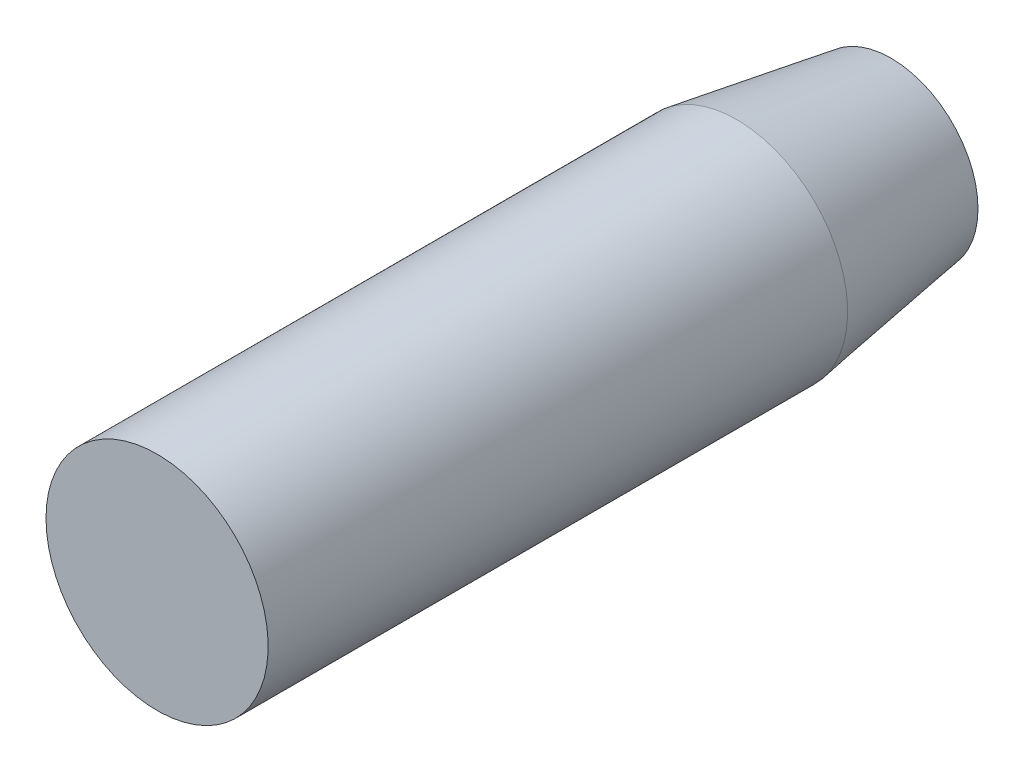
ISO-10303-21;
HEADER;
FILE_DESCRIPTION(('STEP AP214'),'2;1');
FILE_NAME('part.step','',(''),(''),'','','');
FILE_SCHEMA(('AUTOMOTIVE_DESIGN { 1 0 10303 214 1 1 1 1 }'));
ENDSEC;
DATA;
#1=APPLICATION_CONTEXT('core data for automotive mechanical design processes');
#2=APPLICATION_PROTOCOL_DEFINITION('international standard','automotive_design',2000,#1);
#3=PRODUCT_CONTEXT('',#1,'mechanical');
#4=PRODUCT('Part','Part','',(#3));
#5=PRODUCT_RELATED_PRODUCT_CATEGORY('part','',(#4));
#6=PRODUCT_DEFINITION_FORMATION('','',#4);
#7=PRODUCT_DEFINITION_CONTEXT('part definition',#1,'design');
#8=PRODUCT_DEFINITION('design','',#6,#7);
#9=PRODUCT_DEFINITION_SHAPE('','',#8);
#10=(LENGTH_UNIT() NAMED_UNIT(*) SI_UNIT(.MILLI.,.METRE.));
#11=(NAMED_UNIT(*) PLANE_ANGLE_UNIT() SI_UNIT($,.RADIAN.));
#12=(NAMED_UNIT(*) SI_UNIT($,.STERADIAN.) SOLID_ANGLE_UNIT());
#13=UNCERTAINTY_MEASURE_WITH_UNIT(LENGTH_MEASURE(1.E-05),#10,'distance_accuracy_value','');
#14=(GEOMETRIC_REPRESENTATION_CONTEXT(3) GLOBAL_UNCERTAINTY_ASSIGNED_CONTEXT((#13)) GLOBAL_UNIT_ASSIGNED_CONTEXT((#10,
#11,#12)) REPRESENTATION_CONTEXT('',''));
#15=CARTESIAN_POINT('',(0.,0.,0.));
#16=DIRECTION('',(0.,0.,1.));
#17=DIRECTION('',(1.,0.,0.));
#18=AXIS2_PLACEMENT_3D('',#15,#16,#17);
#19=CARTESIAN_POINT('',(0.,0.,-60.325));
#20=DIRECTION('',(0.,0.,1.));
#21=DIRECTION('',(-1.,0.,0.));
#22=AXIS2_PLACEMENT_3D('',#19,#20,#21);
#23=CYLINDRICAL_SURFACE('',#22,18.25625);
#24=CARTESIAN_POINT('',(0.,0.,-34.9250000000015));
#25=DIRECTION('',(0.,0.,1.));
#26=DIRECTION('',(1.,0.,0.));
#27=AXIS2_PLACEMENT_3D('',#24,#25,#26);
#28=CIRCLE('',#27,18.25625);
#29=CARTESIAN_POINT('',(-18.25625,0.,-34.9250000000015));
#30=VERTEX_POINT('',#29);
#31=EDGE_CURVE('E10',#30,#30,#28,.F.);
#32=CARTESIAN_POINT('',(0.,0.,60.325));
#33=DIRECTION('',(0.,0.,1.));
#34=DIRECTION('',(1.,0.,0.));
#35=AXIS2_PLACEMENT_3D('',#32,#33,#34);
#36=CIRCLE('',#35,18.25625);
#37=CARTESIAN_POINT('',(-18.25625,0.,60.325));
#38=VERTEX_POINT('',#37);
#39=EDGE_CURVE('E57',#38,#38,#36,.T.);
#40=CARTESIAN_POINT('',(-18.25625,0.,-34.9250000000015));
#41=CARTESIAN_POINT('',(-18.25625,0.,-33.9328125000015));
#42=CARTESIAN_POINT('',(-18.25625,0.,-32.9406250000014));
#43=CARTESIAN_POINT('',(-18.25625,0.,-30.9562500000014));
#44=CARTESIAN_POINT('',(-18.25625,0.,-29.9640625000014));
#45=CARTESIAN_POINT('',(-18.25625,0.,-27.9796875000014));
#46=CARTESIAN_POINT('',(-18.25625,0.,-26.9875000000014));
#47=CARTESIAN_POINT('',(-18.25625,0.,-25.0031250000013));
#48=CARTESIAN_POINT('',(-18.25625,0.,-24.0109375000013));
#49=CARTESIAN_POINT('',(-18.25625,0.,-22.0265625000013));
#50=CARTESIAN_POINT('',(-18.25625,0.,-21.0343750000013));
#51=CARTESIAN_POINT('',(-18.25625,0.,-19.0500000000012));
#52=CARTESIAN_POINT('',(-18.25625,0.,-18.0578125000012));
#53=CARTESIAN_POINT('',(-18.25625,0.,-16.0734375000012));
#54=CARTESIAN_POINT('',(-18.25625,0.,-15.0812500000012));
#55=CARTESIAN_POINT('',(-18.25625,0.,-13.0968750000011));
#56=CARTESIAN_POINT('',(-18.25625,0.,-12.1046875000011));
#57=CARTESIAN_POINT('',(-18.25625,0.,-10.1203125000011));
#58=CARTESIAN_POINT('',(-18.25625,0.,-9.12812500000108));
#59=CARTESIAN_POINT('',(-18.25625,0.,-7.14375000000105));
#60=CARTESIAN_POINT('',(-18.25625,0.,-6.15156250000103));
#61=CARTESIAN_POINT('',(-18.25625,0.,-4.167187500001));
#62=CARTESIAN_POINT('',(-18.25625,0.,-3.17500000000099));
#63=CARTESIAN_POINT('',(-18.25625,0.,-1.19062500000096));
#64=CARTESIAN_POINT('',(-18.25625,0.,-0.198437500000941));
#65=CARTESIAN_POINT('',(-18.25625,0.,1.78593749999909));
#66=CARTESIAN_POINT('',(-18.25625,0.,2.7781249999991));
#67=CARTESIAN_POINT('',(-18.25625,0.,4.76249999999913));
#68=CARTESIAN_POINT('',(-18.25625,0.,5.75468749999915));
#69=CARTESIAN_POINT('',(-18.25625,0.,7.73906249999918));
#70=CARTESIAN_POINT('',(-18.25625,0.,8.7312499999992));
#71=CARTESIAN_POINT('',(-18.25625,0.,10.7156249999992));
#72=CARTESIAN_POINT('',(-18.25625,0.,11.7078124999992));
#73=CARTESIAN_POINT('',(-18.25625,0.,13.6921874999993));
#74=CARTESIAN_POINT('',(-18.25625,0.,14.6843749999993));
#75=CARTESIAN_POINT('',(-18.25625,0.,16.6687499999993));
#76=CARTESIAN_POINT('',(-18.25625,0.,17.6609374999993));
#77=CARTESIAN_POINT('',(-18.25625,0.,19.6453124999994));
#78=CARTESIAN_POINT('',(-18.25625,0.,20.6374999999994));
#79=CARTESIAN_POINT('',(-18.25625,0.,22.6218749999994));
#80=CARTESIAN_POINT('',(-18.25625,0.,23.6140624999994));
#81=CARTESIAN_POINT('',(-18.25625,0.,25.5984374999995));
#82=CARTESIAN_POINT('',(-18.25625,0.,26.5906249999995));
#83=CARTESIAN_POINT('',(-18.25625,0.,28.5749999999995));
#84=CARTESIAN_POINT('',(-18.25625,0.,29.5671874999995));
#85=CARTESIAN_POINT('',(-18.25625,0.,31.5515624999995));
#86=CARTESIAN_POINT('',(-18.25625,0.,32.5437499999996));
#87=CARTESIAN_POINT('',(-18.25625,0.,34.5281249999996));
#88=CARTESIAN_POINT('',(-18.25625,0.,35.5203124999996));
#89=CARTESIAN_POINT('',(-18.25625,0.,37.5046874999996));
#90=CARTESIAN_POINT('',(-18.25625,0.,38.4968749999997));
#91=CARTESIAN_POINT('',(-18.25625,0.,40.4812499999997));
#92=CARTESIAN_POINT('',(-18.25625,0.,41.4734374999997));
#93=CARTESIAN_POINT('',(-18.25625,0.,43.4578124999997));
#94=CARTESIAN_POINT('',(-18.25625,0.,44.4499999999997));
#95=CARTESIAN_POINT('',(-18.25625,0.,46.4343749999998));
#96=CARTESIAN_POINT('',(-18.25625,0.,47.4265624999998));
#97=CARTESIAN_POINT('',(-18.25625,0.,49.4109374999998));
#98=CARTESIAN_POINT('',(-18.25625,0.,50.4031249999998));
#99=CARTESIAN_POINT('',(-18.25625,0.,52.3874999999999));
#100=CARTESIAN_POINT('',(-18.25625,0.,53.3796874999999));
#101=CARTESIAN_POINT('',(-18.25625,0.,55.3640624999999));
#102=CARTESIAN_POINT('',(-18.25625,0.,56.3562499999999));
#103=CARTESIAN_POINT('',(-18.25625,0.,58.340625));
#104=CARTESIAN_POINT('',(-18.25625,0.,59.3328125));
#105=CARTESIAN_POINT('',(-18.25625,0.,60.325));
#106=B_SPLINE_CURVE_WITH_KNOTS('',3,(#40,#41,#42,#43,#44,#45,#46,#47,#48,#49,#50,#51,#52,#53,
#54,#55,#56,#57,#58,#59,#60,#61,#62,#63,#64,#65,#66,#67,#68,#69,#70,#71,#72,#73,#74,#75,#76,#77,
#78,#79,#80,#81,#82,#83,#84,#85,#86,#87,#88,#89,#90,#91,#92,#93,#94,#95,#96,#97,#98,#99,#100,
#101,#102,#103,#104,#105),.UNSPECIFIED.,.F.,.F.,(4,2,2,2,2,2,2,2,2,2,2,2,2,2,2,2,2,2,2,2,2,2,2,
2,2,2,2,2,2,2,2,2,4),(0.,2.97656250000004,5.95312500000009,8.92968750000013,11.9062500000002,
14.8828125000002,17.8593750000003,20.8359375000003,23.8125000000004,26.7890625000004,
29.7656250000005,32.7421875000005,35.7187500000005,38.6953125000006,41.6718750000006,
44.6484375000007,47.6250000000007,50.6015625000008,53.5781250000008,56.5546875000009,
59.5312500000009,62.507812500001,65.484375000001,68.460937500001,71.4375000000011,
74.4140625000012,77.3906250000012,80.3671875000012,83.3437500000013,86.3203125000013,
89.2968750000014,92.2734375000014,95.2500000000015),.UNSPECIFIED.);
#107=EDGE_CURVE('BSEAM43',#30,#38,#106,.T.);
#108=ORIENTED_EDGE('',*,*,#31,.F.);
#109=ORIENTED_EDGE('',*,*,#39,.F.);
#110=ORIENTED_EDGE('',*,*,#107,.T.);
#111=ORIENTED_EDGE('',*,*,#107,.F.);
#112=EDGE_LOOP('',(#108,#110,#109,#111));
#113=FACE_BOUND('',#112,.T.);
#114=ADVANCED_FACE('F43',(#113),#23,.T.);
#115=CARTESIAN_POINT('',(0.,0.,-60.325));
#116=DIRECTION('',(0.,0.,-1.));
#117=DIRECTION('',(1.,0.,0.));
#118=AXIS2_PLACEMENT_3D('',#115,#116,#117);
#119=PLANE('',#118);
#120=CARTESIAN_POINT('',(0.,0.,-60.325));
#121=DIRECTION('',(0.,0.,1.));
#122=DIRECTION('',(1.,0.,0.));
#123=AXIS2_PLACEMENT_3D('',#120,#121,#122);
#124=CIRCLE('',#123,14.2875000000003);
#125=CARTESIAN_POINT('',(-14.2875000000003,0.,-60.325));
#126=VERTEX_POINT('',#125);
#127=EDGE_CURVE('E51',#126,#126,#124,.T.);
#128=ORIENTED_EDGE('',*,*,#127,.F.);
#129=EDGE_LOOP('',(#128));
#130=FACE_BOUND('',#129,.T.);
#131=ADVANCED_FACE('F67',(#130),#119,.T.);
#132=CARTESIAN_POINT('',(0.,0.,60.325));
#133=DIRECTION('',(0.,0.,-1.));
#134=DIRECTION('',(1.,0.,0.));
#135=AXIS2_PLACEMENT_3D('',#132,#133,#134);
#136=PLANE('',#135);
#137=ORIENTED_EDGE('',*,*,#39,.T.);
#138=EDGE_LOOP('',(#137));
#139=FACE_BOUND('',#138,.T.);
#140=ADVANCED_FACE('F64',(#139),#136,.F.);
#141=CARTESIAN_POINT('',(0.,0.,-60.325));
#142=DIRECTION('',(0.,0.,1.));
#143=DIRECTION('',(-1.,0.,0.));
#144=AXIS2_PLACEMENT_3D('',#141,#142,#143);
#145=CONICAL_SURFACE('',#144,14.2875000000003,0.154996741923938);
#146=CARTESIAN_POINT('',(-18.25625,0.,-34.9250000000015));
#147=CARTESIAN_POINT('',(-18.2149088541667,0.,-35.1895833333348));
#148=CARTESIAN_POINT('',(-18.1735677083333,0.,-35.4541666666681));
#149=CARTESIAN_POINT('',(-18.0908854166667,0.,-35.9833333333347));
#150=CARTESIAN_POINT('',(-18.0495442708333,0.,-36.2479166666681));
#151=CARTESIAN_POINT('',(-17.9668619791667,0.,-36.7770833333347));
#152=CARTESIAN_POINT('',(-17.9255208333334,0.,-37.041666666668));
#153=CARTESIAN_POINT('',(-17.8428385416667,0.,-37.5708333333346));
#154=CARTESIAN_POINT('',(-17.8014973958334,0.,-37.835416666668));
#155=CARTESIAN_POINT('',(-17.7188151041667,0.,-38.3645833333346));
#156=CARTESIAN_POINT('',(-17.6774739583334,0.,-38.6291666666679));
#157=CARTESIAN_POINT('',(-17.5947916666667,0.,-39.1583333333346));
#158=CARTESIAN_POINT('',(-17.5534505208334,0.,-39.4229166666679));
#159=CARTESIAN_POINT('',(-17.4707682291667,0.,-39.9520833333345));
#160=CARTESIAN_POINT('',(-17.4294270833334,0.,-40.2166666666678));
#161=CARTESIAN_POINT('',(-17.3467447916667,0.,-40.7458333333345));
#162=CARTESIAN_POINT('',(-17.3054036458334,0.,-41.0104166666678));
#163=CARTESIAN_POINT('',(-17.2227213541668,0.,-41.5395833333344));
#164=CARTESIAN_POINT('',(-17.1813802083334,0.,-41.8041666666677));
#165=CARTESIAN_POINT('',(-17.0986979166668,0.,-42.3333333333344));
#166=CARTESIAN_POINT('',(-17.0573567708334,0.,-42.5979166666677));
#167=CARTESIAN_POINT('',(-16.9746744791668,0.,-43.1270833333343));
#168=CARTESIAN_POINT('',(-16.9333333333334,0.,-43.3916666666676));
#169=CARTESIAN_POINT('',(-16.8506510416668,0.,-43.9208333333343));
#170=CARTESIAN_POINT('',(-16.8093098958335,0.,-44.1854166666676));
#171=CARTESIAN_POINT('',(-16.7266276041668,0.,-44.7145833333342));
#172=CARTESIAN_POINT('',(-16.6852864583335,0.,-44.9791666666676));
#173=CARTESIAN_POINT('',(-16.6026041666668,0.,-45.5083333333342));
#174=CARTESIAN_POINT('',(-16.5612630208335,0.,-45.7729166666675));
#175=CARTESIAN_POINT('',(-16.4785807291668,0.,-46.3020833333341));
#176=CARTESIAN_POINT('',(-16.4372395833335,0.,-46.5666666666675));
#177=CARTESIAN_POINT('',(-16.3545572916668,0.,-47.0958333333341));
#178=CARTESIAN_POINT('',(-16.3132161458335,0.,-47.3604166666674));
#179=CARTESIAN_POINT('',(-16.2305338541668,0.,-47.8895833333341));
#180=CARTESIAN_POINT('',(-16.1891927083335,0.,-48.1541666666674));
#181=CARTESIAN_POINT('',(-16.1065104166668,0.,-48.683333333334));
#182=CARTESIAN_POINT('',(-16.0651692708335,0.,-48.9479166666673));
#183=CARTESIAN_POINT('',(-15.9824869791668,0.,-49.477083333334));
#184=CARTESIAN_POINT('',(-15.9411458333335,0.,-49.7416666666673));
#185=CARTESIAN_POINT('',(-15.8584635416669,0.,-50.2708333333339));
#186=CARTESIAN_POINT('',(-15.8171223958335,0.,-50.5354166666672));
#187=CARTESIAN_POINT('',(-15.7344401041669,0.,-51.0645833333339));
#188=CARTESIAN_POINT('',(-15.6930989583335,0.,-51.3291666666672));
#189=CARTESIAN_POINT('',(-15.6104166666669,0.,-51.8583333333338));
#190=CARTESIAN_POINT('',(-15.5690755208336,0.,-52.1229166666671));
#191=CARTESIAN_POINT('',(-15.4863932291669,0.,-52.6520833333338));
#192=CARTESIAN_POINT('',(-15.4450520833336,0.,-52.9166666666671));
#193=CARTESIAN_POINT('',(-15.3623697916669,0.,-53.4458333333337));
#194=CARTESIAN_POINT('',(-15.3210286458336,0.,-53.7104166666671));
#195=CARTESIAN_POINT('',(-15.2383463541669,0.,-54.2395833333337));
#196=CARTESIAN_POINT('',(-15.1970052083336,0.,-54.504166666667));
#197=CARTESIAN_POINT('',(-15.1143229166669,0.,-55.0333333333336));
#198=CARTESIAN_POINT('',(-15.0729817708336,0.,-55.297916666667));
#199=CARTESIAN_POINT('',(-14.9902994791669,0.,-55.8270833333336));
#200=CARTESIAN_POINT('',(-14.9489583333336,0.,-56.0916666666669));
#201=CARTESIAN_POINT('',(-14.8662760416669,0.,-56.6208333333336));
#202=CARTESIAN_POINT('',(-14.8249348958336,0.,-56.8854166666669));
#203=CARTESIAN_POINT('',(-14.7422526041669,0.,-57.4145833333335));
#204=CARTESIAN_POINT('',(-14.7009114583336,0.,-57.6791666666668));
#205=CARTESIAN_POINT('',(-14.618229166667,0.,-58.2083333333335));
#206=CARTESIAN_POINT('',(-14.5768880208336,0.,-58.4729166666668));
#207=CARTESIAN_POINT('',(-14.494205729167,0.,-59.0020833333334));
#208=CARTESIAN_POINT('',(-14.4528645833336,0.,-59.2666666666667));
#209=CARTESIAN_POINT('',(-14.370182291667,0.,-59.7958333333334));
#210=CARTESIAN_POINT('',(-14.3288411458337,0.,-60.0604166666667));
#211=CARTESIAN_POINT('',(-14.2875000000003,0.,-60.325));
#212=B_SPLINE_CURVE_WITH_KNOTS('',3,(#146,#147,#148,#149,#150,#151,#152,#153,#154,#155,#156,
#157,#158,#159,#160,#161,#162,#163,#164,#165,#166,#167,#168,#169,#170,#171,#172,#173,#174,#175,
#176,#177,#178,#179,#180,#181,#182,#183,#184,#185,#186,#187,#188,#189,#190,#191,#192,#193,#194,
#195,#196,#197,#198,#199,#200,#201,#202,#203,#204,#205,#206,#207,#208,#209,#210,#211),
.UNSPECIFIED.,.F.,.F.,(4,2,2,2,2,2,2,2,2,2,2,2,2,2,2,2,2,2,2,2,2,2,2,2,2,2,2,2,2,2,2,2,4),(0.,
0.803380903151949,1.6067618063039,2.41014270945585,3.2135236126078,4.01690451575974,
4.82028541891169,5.62366632206364,6.42704722521559,7.23042812836754,8.03380903151949,
8.83718993467144,9.64057083782339,10.4439517409753,11.2473326441273,12.0507135472792,
12.8540944504312,13.6574753535831,14.4608562567351,15.264237159887,16.067618063039,
16.8709989661909,17.6743798693429,18.4777607724948,19.2811416756468,20.0845225787987,
20.8879034819507,21.6912843851026,22.4946652882546,23.2980461914065,24.1014270945585,
24.9048079977104,25.7081889008623),.UNSPECIFIED.);
#213=EDGE_CURVE('BSEAM45',#30,#126,#212,.T.);
#214=ORIENTED_EDGE('',*,*,#31,.T.);
#215=ORIENTED_EDGE('',*,*,#127,.T.);
#216=ORIENTED_EDGE('',*,*,#213,.T.);
#217=ORIENTED_EDGE('',*,*,#213,.F.);
#218=EDGE_LOOP('',(#214,#216,#215,#217));
#219=FACE_BOUND('',#218,.T.);
#220=ADVANCED_FACE('F45',(#219),#145,.T.);
#221=CLOSED_SHELL('',(#114,#131,#140,#220));
#222=MANIFOLD_SOLID_BREP('B2',#221);
#223=ADVANCED_BREP_SHAPE_REPRESENTATION('',(#18,#222),#14);
#224=SHAPE_DEFINITION_REPRESENTATION(#9,#223);
ENDSEC;
END-ISO-10303-21;
